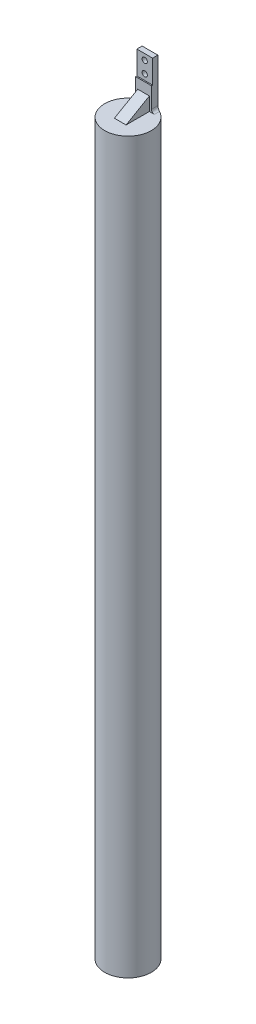
ISO-10303-21;
HEADER;
FILE_DESCRIPTION(('STEP AP214'),'2;1');
FILE_NAME('part.step','',(''),(''),'','','');
FILE_SCHEMA(('AUTOMOTIVE_DESIGN { 1 0 10303 214 1 1 1 1 }'));
ENDSEC;
DATA;
#1=APPLICATION_CONTEXT('core data for automotive mechanical design processes');
#2=APPLICATION_PROTOCOL_DEFINITION('international standard','automotive_design',2000,#1);
#3=PRODUCT_CONTEXT('',#1,'mechanical');
#4=PRODUCT('Part','Part','',(#3));
#5=PRODUCT_RELATED_PRODUCT_CATEGORY('part','',(#4));
#6=PRODUCT_DEFINITION_FORMATION('','',#4);
#7=PRODUCT_DEFINITION_CONTEXT('part definition',#1,'design');
#8=PRODUCT_DEFINITION('design','',#6,#7);
#9=PRODUCT_DEFINITION_SHAPE('','',#8);
#10=(LENGTH_UNIT() NAMED_UNIT(*) SI_UNIT(.MILLI.,.METRE.));
#11=(NAMED_UNIT(*) PLANE_ANGLE_UNIT() SI_UNIT($,.RADIAN.));
#12=(NAMED_UNIT(*) SI_UNIT($,.STERADIAN.) SOLID_ANGLE_UNIT());
#13=UNCERTAINTY_MEASURE_WITH_UNIT(LENGTH_MEASURE(1.E-05),#10,'distance_accuracy_value','');
#14=(GEOMETRIC_REPRESENTATION_CONTEXT(3) GLOBAL_UNCERTAINTY_ASSIGNED_CONTEXT((#13)) GLOBAL_UNIT_ASSIGNED_CONTEXT((#10,
#11,#12)) REPRESENTATION_CONTEXT('',''));
#15=CARTESIAN_POINT('',(0.,0.,0.));
#16=DIRECTION('',(0.,0.,1.));
#17=DIRECTION('',(1.,0.,0.));
#18=AXIS2_PLACEMENT_3D('',#15,#16,#17);
#19=CARTESIAN_POINT('',(-1.35,4.,0.55));
#20=DIRECTION('',(0.,0.,-1.));
#21=DIRECTION('',(-1.,0.,0.));
#22=AXIS2_PLACEMENT_3D('',#19,#20,#21);
#23=PLANE('',#22);
#24=DIRECTION('',(0.,1.,0.));
#25=VECTOR('',#24,1.);
#26=CARTESIAN_POINT('',(1.,0.,0.55));
#27=LINE('',#26,#25);
#28=CARTESIAN_POINT('',(1.,0.,0.55));
#29=VERTEX_POINT('',#28);
#30=CARTESIAN_POINT('',(1.,2.30940107675847,0.55));
#31=VERTEX_POINT('',#30);
#32=EDGE_CURVE('E297',#29,#31,#27,.T.);
#33=ORIENTED_EDGE('',*,*,#32,.F.);
#34=DIRECTION('',(1.,0.,0.));
#35=VECTOR('',#34,1.);
#36=CARTESIAN_POINT('',(-1.35,0.,0.55));
#37=LINE('',#36,#35);
#38=CARTESIAN_POINT('',(1.85,0.,0.55));
#39=VERTEX_POINT('',#38);
#40=EDGE_CURVE('E127',#29,#39,#37,.T.);
#41=ORIENTED_EDGE('',*,*,#40,.T.);
#42=CARTESIAN_POINT('',(1.85,0.5,0.55));
#43=DIRECTION('',(0.,0.,-1.));
#44=DIRECTION('',(-1.,0.,0.));
#45=AXIS2_PLACEMENT_3D('',#42,#43,#44);
#46=CIRCLE('',#45,0.5);
#47=CARTESIAN_POINT('',(1.35,0.5,0.55));
#48=VERTEX_POINT('',#47);
#49=EDGE_CURVE('E135',#39,#48,#46,.T.);
#50=ORIENTED_EDGE('',*,*,#49,.T.);
#51=DIRECTION('',(0.,-1.,0.));
#52=VECTOR('',#51,1.);
#53=CARTESIAN_POINT('',(1.35,4.,0.55));
#54=LINE('',#53,#52);
#55=CARTESIAN_POINT('',(1.35,4.,0.55));
#56=VERTEX_POINT('',#55);
#57=EDGE_CURVE('E246',#56,#48,#54,.T.);
#58=ORIENTED_EDGE('',*,*,#57,.F.);
#59=DIRECTION('',(1.,0.,0.));
#60=VECTOR('',#59,1.);
#61=CARTESIAN_POINT('',(-1.35,4.,0.55));
#62=LINE('',#61,#60);
#63=CARTESIAN_POINT('',(-1.35,4.,0.55));
#64=VERTEX_POINT('',#63);
#65=EDGE_CURVE('E243',#64,#56,#62,.T.);
#66=ORIENTED_EDGE('',*,*,#65,.F.);
#67=DIRECTION('',(0.,-1.,0.));
#68=VECTOR('',#67,1.);
#69=CARTESIAN_POINT('',(-1.35,4.,0.55));
#70=LINE('',#69,#68);
#71=CARTESIAN_POINT('',(-1.35,0.5,0.55));
#72=VERTEX_POINT('',#71);
#73=EDGE_CURVE('E133',#64,#72,#70,.T.);
#74=ORIENTED_EDGE('',*,*,#73,.T.);
#75=CARTESIAN_POINT('',(-1.85,0.5,0.55));
#76=DIRECTION('',(0.,0.,-1.));
#77=DIRECTION('',(-1.,0.,0.));
#78=AXIS2_PLACEMENT_3D('',#75,#76,#77);
#79=CIRCLE('',#78,0.5);
#80=CARTESIAN_POINT('',(-1.85,0.,0.55));
#81=VERTEX_POINT('',#80);
#82=EDGE_CURVE('E63',#72,#81,#79,.T.);
#83=ORIENTED_EDGE('',*,*,#82,.T.);
#84=CARTESIAN_POINT('',(-1.,0.,0.55));
#85=VERTEX_POINT('',#84);
#86=EDGE_CURVE('E117',#81,#85,#37,.T.);
#87=ORIENTED_EDGE('',*,*,#86,.T.);
#88=DIRECTION('',(0.,1.,0.));
#89=VECTOR('',#88,1.);
#90=CARTESIAN_POINT('',(-1.,0.,0.55));
#91=LINE('',#90,#89);
#92=CARTESIAN_POINT('',(-1.,2.30940107675847,0.55));
#93=VERTEX_POINT('',#92);
#94=EDGE_CURVE('E104',#85,#93,#91,.T.);
#95=ORIENTED_EDGE('',*,*,#94,.T.);
#96=DIRECTION('',(-1.,0.,0.));
#97=VECTOR('',#96,1.);
#98=CARTESIAN_POINT('',(1.,2.30940107675847,0.55));
#99=LINE('',#98,#97);
#100=EDGE_CURVE('E282',#31,#93,#99,.T.);
#101=ORIENTED_EDGE('',*,*,#100,.F.);
#102=EDGE_LOOP('',(#33,#41,#50,#58,#66,#74,#83,#87,#95,#101));
#103=FACE_BOUND('',#102,.T.);
#104=ADVANCED_FACE('F48',(#103),#23,.F.);
#105=CARTESIAN_POINT('',(0.,0.,0.));
#106=DIRECTION('',(0.,-1.,0.));
#107=DIRECTION('',(0.,0.,-1.));
#108=AXIS2_PLACEMENT_3D('',#105,#106,#107);
#109=PLANE('',#108);
#110=CARTESIAN_POINT('',(0.,0.,3.21530211271287));
#111=DIRECTION('',(0.,-1.,0.));
#112=DIRECTION('',(0.,0.,-1.));
#113=AXIS2_PLACEMENT_3D('',#110,#111,#112);
#114=CIRCLE('',#113,4.);
#115=CARTESIAN_POINT('',(1.85,0.,-0.331175012548196));
#116=VERTEX_POINT('',#115);
#117=CARTESIAN_POINT('',(-1.85,0.,-0.331175012548196));
#118=VERTEX_POINT('',#117);
#119=EDGE_CURVE('E279',#116,#118,#114,.T.);
#120=ORIENTED_EDGE('',*,*,#119,.F.);
#121=DIRECTION('',(0.,0.,-1.));
#122=VECTOR('',#121,1.);
#123=CARTESIAN_POINT('',(1.85,0.,0.55));
#124=LINE('',#123,#122);
#125=EDGE_CURVE('E138',#116,#39,#124,.F.);
#126=ORIENTED_EDGE('',*,*,#125,.T.);
#127=ORIENTED_EDGE('',*,*,#40,.F.);
#128=DIRECTION('',(0.,0.,-1.));
#129=VECTOR('',#128,1.);
#130=CARTESIAN_POINT('',(1.,0.,4.55));
#131=LINE('',#130,#129);
#132=CARTESIAN_POINT('',(1.,0.,4.55));
#133=VERTEX_POINT('',#132);
#134=EDGE_CURVE('E294',#133,#29,#131,.T.);
#135=ORIENTED_EDGE('',*,*,#134,.F.);
#136=DIRECTION('',(-1.,0.,0.));
#137=VECTOR('',#136,1.);
#138=CARTESIAN_POINT('',(1.,0.,4.55));
#139=LINE('',#138,#137);
#140=CARTESIAN_POINT('',(-1.,0.,4.55));
#141=VERTEX_POINT('',#140);
#142=EDGE_CURVE('E291',#133,#141,#139,.T.);
#143=ORIENTED_EDGE('',*,*,#142,.T.);
#144=DIRECTION('',(0.,0.,-1.));
#145=VECTOR('',#144,1.);
#146=CARTESIAN_POINT('',(-1.,0.,4.55));
#147=LINE('',#146,#145);
#148=EDGE_CURVE('E123',#141,#85,#147,.T.);
#149=ORIENTED_EDGE('',*,*,#148,.T.);
#150=ORIENTED_EDGE('',*,*,#86,.F.);
#151=DIRECTION('',(0.,0.,1.));
#152=VECTOR('',#151,1.);
#153=CARTESIAN_POINT('',(-1.85,0.,-0.55));
#154=LINE('',#153,#152);
#155=EDGE_CURVE('E120',#81,#118,#154,.F.);
#156=ORIENTED_EDGE('',*,*,#155,.T.);
#157=EDGE_LOOP('',(#120,#126,#127,#135,#143,#149,#150,#156));
#158=FACE_BOUND('',#157,.T.);
#159=ADVANCED_FACE('F119',(#158),#109,.F.);
#160=CARTESIAN_POINT('',(1.35,4.,-0.55));
#161=DIRECTION('',(-1.,0.,0.));
#162=DIRECTION('',(0.,0.,1.));
#163=AXIS2_PLACEMENT_3D('',#160,#161,#162);
#164=PLANE('',#163);
#165=ORIENTED_EDGE('',*,*,#57,.T.);
#166=DIRECTION('',(0.,0.,-1.));
#167=VECTOR('',#166,1.);
#168=CARTESIAN_POINT('',(1.35,0.5,-0.55));
#169=LINE('',#168,#167);
#170=CARTESIAN_POINT('',(1.35,0.5,-0.55));
#171=VERTEX_POINT('',#170);
#172=EDGE_CURVE('E139',#48,#171,#169,.T.);
#173=ORIENTED_EDGE('',*,*,#172,.T.);
#174=DIRECTION('',(0.,-1.,0.));
#175=VECTOR('',#174,1.);
#176=CARTESIAN_POINT('',(1.35,4.,-0.55));
#177=LINE('',#176,#175);
#178=CARTESIAN_POINT('',(1.35,8.,-0.55));
#179=VERTEX_POINT('',#178);
#180=EDGE_CURVE('E149',#179,#171,#177,.T.);
#181=ORIENTED_EDGE('',*,*,#180,.F.);
#182=DIRECTION('',(0.,0.,-1.));
#183=VECTOR('',#182,1.);
#184=CARTESIAN_POINT('',(1.35,8.,-0.55));
#185=LINE('',#184,#183);
#186=CARTESIAN_POINT('',(1.35,8.,0.35));
#187=VERTEX_POINT('',#186);
#188=EDGE_CURVE('E262',#187,#179,#185,.T.);
#189=ORIENTED_EDGE('',*,*,#188,.F.);
#190=DIRECTION('',(0.,-1.,0.));
#191=VECTOR('',#190,1.);
#192=CARTESIAN_POINT('',(1.35,8.,0.35));
#193=LINE('',#192,#191);
#194=CARTESIAN_POINT('',(1.35,4.,0.35));
#195=VERTEX_POINT('',#194);
#196=EDGE_CURVE('E228',#187,#195,#193,.T.);
#197=ORIENTED_EDGE('',*,*,#196,.T.);
#198=DIRECTION('',(0.,0.,-1.));
#199=VECTOR('',#198,1.);
#200=CARTESIAN_POINT('',(1.35,4.,-0.55));
#201=LINE('',#200,#199);
#202=EDGE_CURVE('E126',#56,#195,#201,.T.);
#203=ORIENTED_EDGE('',*,*,#202,.F.);
#204=EDGE_LOOP('',(#165,#173,#181,#189,#197,#203));
#205=FACE_BOUND('',#204,.T.);
#206=ADVANCED_FACE('F172',(#205),#164,.F.);
#207=CARTESIAN_POINT('',(-1.35,4.,-0.55));
#208=DIRECTION('',(0.,0.,1.));
#209=DIRECTION('',(1.,0.,0.));
#210=AXIS2_PLACEMENT_3D('',#207,#208,#209);
#211=PLANE('',#210);
#212=CARTESIAN_POINT('',(0.,5.,-0.55));
#213=DIRECTION('',(0.,0.,1.));
#214=DIRECTION('',(1.,0.,0.));
#215=AXIS2_PLACEMENT_3D('',#212,#213,#214);
#216=CIRCLE('',#215,0.45);
#217=CARTESIAN_POINT('',(0.45,5.,-0.55));
#218=VERTEX_POINT('',#217);
#219=EDGE_CURVE('E303',#218,#218,#216,.F.);
#220=ORIENTED_EDGE('',*,*,#219,.F.);
#221=EDGE_LOOP('',(#220));
#222=FACE_BOUND('',#221,.T.);
#223=CARTESIAN_POINT('',(0.,7.,-0.55));
#224=DIRECTION('',(0.,0.,1.));
#225=DIRECTION('',(1.,0.,0.));
#226=AXIS2_PLACEMENT_3D('',#223,#224,#225);
#227=CIRCLE('',#226,0.45);
#228=CARTESIAN_POINT('',(0.449999999999999,7.,-0.55));
#229=VERTEX_POINT('',#228);
#230=EDGE_CURVE('E314',#229,#229,#227,.F.);
#231=ORIENTED_EDGE('',*,*,#230,.F.);
#232=EDGE_LOOP('',(#231));
#233=FACE_BOUND('',#232,.T.);
#234=ORIENTED_EDGE('',*,*,#180,.T.);
#235=DIRECTION('',(0.,1.,0.));
#236=VECTOR('',#235,1.);
#237=CARTESIAN_POINT('',(1.35,-125.,-0.55));
#238=LINE('',#237,#236);
#239=CARTESIAN_POINT('',(1.35,-125.,-0.55));
#240=VERTEX_POINT('',#239);
#241=EDGE_CURVE('E92',#240,#171,#238,.T.);
#242=ORIENTED_EDGE('',*,*,#241,.F.);
#243=DIRECTION('',(1.,0.,0.));
#244=VECTOR('',#243,1.);
#245=CARTESIAN_POINT('',(0.,-125.,-0.55));
#246=LINE('',#245,#244);
#247=CARTESIAN_POINT('',(-1.35,-125.,-0.55));
#248=VERTEX_POINT('',#247);
#249=EDGE_CURVE('E276',#248,#240,#246,.T.);
#250=ORIENTED_EDGE('',*,*,#249,.F.);
#251=DIRECTION('',(0.,1.,0.));
#252=VECTOR('',#251,1.);
#253=CARTESIAN_POINT('',(-1.35,-125.,-0.55));
#254=LINE('',#253,#252);
#255=CARTESIAN_POINT('',(-1.35,0.5,-0.55));
#256=VERTEX_POINT('',#255);
#257=EDGE_CURVE('E70',#248,#256,#254,.T.);
#258=ORIENTED_EDGE('',*,*,#257,.T.);
#259=DIRECTION('',(0.,-1.,0.));
#260=VECTOR('',#259,1.);
#261=CARTESIAN_POINT('',(-1.35,4.,-0.55));
#262=LINE('',#261,#260);
#263=CARTESIAN_POINT('',(-1.35,8.,-0.55));
#264=VERTEX_POINT('',#263);
#265=EDGE_CURVE('E253',#264,#256,#262,.T.);
#266=ORIENTED_EDGE('',*,*,#265,.F.);
#267=DIRECTION('',(-1.,0.,0.));
#268=VECTOR('',#267,1.);
#269=CARTESIAN_POINT('',(-1.35,8.,-0.55));
#270=LINE('',#269,#268);
#271=EDGE_CURVE('E214',#179,#264,#270,.T.);
#272=ORIENTED_EDGE('',*,*,#271,.F.);
#273=EDGE_LOOP('',(#234,#242,#250,#258,#266,#272));
#274=FACE_BOUND('',#273,.T.);
#275=ADVANCED_FACE('F175',(#222,#233,#274),#211,.F.);
#276=CARTESIAN_POINT('',(-1.35,4.,-0.55));
#277=DIRECTION('',(1.,0.,0.));
#278=DIRECTION('',(0.,0.,-1.));
#279=AXIS2_PLACEMENT_3D('',#276,#277,#278);
#280=PLANE('',#279);
#281=ORIENTED_EDGE('',*,*,#265,.T.);
#282=DIRECTION('',(0.,0.,1.));
#283=VECTOR('',#282,1.);
#284=CARTESIAN_POINT('',(-1.35,0.5,0.55));
#285=LINE('',#284,#283);
#286=EDGE_CURVE('E145',#256,#72,#285,.T.);
#287=ORIENTED_EDGE('',*,*,#286,.T.);
#288=ORIENTED_EDGE('',*,*,#73,.F.);
#289=DIRECTION('',(0.,0.,1.));
#290=VECTOR('',#289,1.);
#291=CARTESIAN_POINT('',(-1.35,4.,-0.55));
#292=LINE('',#291,#290);
#293=CARTESIAN_POINT('',(-1.35,4.,0.35));
#294=VERTEX_POINT('',#293);
#295=EDGE_CURVE('E224',#294,#64,#292,.T.);
#296=ORIENTED_EDGE('',*,*,#295,.F.);
#297=DIRECTION('',(0.,-1.,0.));
#298=VECTOR('',#297,1.);
#299=CARTESIAN_POINT('',(-1.35,8.,0.35));
#300=LINE('',#299,#298);
#301=CARTESIAN_POINT('',(-1.35,8.,0.35));
#302=VERTEX_POINT('',#301);
#303=EDGE_CURVE('E222',#302,#294,#300,.T.);
#304=ORIENTED_EDGE('',*,*,#303,.F.);
#305=DIRECTION('',(0.,0.,1.));
#306=VECTOR('',#305,1.);
#307=CARTESIAN_POINT('',(-1.35,8.,-0.55));
#308=LINE('',#307,#306);
#309=EDGE_CURVE('E205',#264,#302,#308,.T.);
#310=ORIENTED_EDGE('',*,*,#309,.F.);
#311=EDGE_LOOP('',(#281,#287,#288,#296,#304,#310));
#312=FACE_BOUND('',#311,.T.);
#313=ADVANCED_FACE('F179',(#312),#280,.F.);
#314=CARTESIAN_POINT('',(0.,4.,0.));
#315=DIRECTION('',(0.,1.,0.));
#316=DIRECTION('',(0.,0.,1.));
#317=AXIS2_PLACEMENT_3D('',#314,#315,#316);
#318=PLANE('',#317);
#319=DIRECTION('',(1.,0.,0.));
#320=VECTOR('',#319,1.);
#321=CARTESIAN_POINT('',(-1.35,4.,0.35));
#322=LINE('',#321,#320);
#323=EDGE_CURVE('E218',#294,#195,#322,.T.);
#324=ORIENTED_EDGE('',*,*,#323,.F.);
#325=ORIENTED_EDGE('',*,*,#295,.T.);
#326=ORIENTED_EDGE('',*,*,#65,.T.);
#327=ORIENTED_EDGE('',*,*,#202,.T.);
#328=EDGE_LOOP('',(#324,#325,#326,#327));
#329=FACE_BOUND('',#328,.T.);
#330=ADVANCED_FACE('F183',(#329),#318,.T.);
#331=CARTESIAN_POINT('',(-1.35,8.,0.35));
#332=DIRECTION('',(0.,0.,-1.));
#333=DIRECTION('',(-1.,0.,0.));
#334=AXIS2_PLACEMENT_3D('',#331,#332,#333);
#335=PLANE('',#334);
#336=CARTESIAN_POINT('',(0.,5.,0.35));
#337=DIRECTION('',(0.,0.,1.));
#338=DIRECTION('',(1.,0.,0.));
#339=AXIS2_PLACEMENT_3D('',#336,#337,#338);
#340=CIRCLE('',#339,0.45);
#341=CARTESIAN_POINT('',(0.45,5.,0.35));
#342=VERTEX_POINT('',#341);
#343=EDGE_CURVE('E318',#342,#342,#340,.T.);
#344=ORIENTED_EDGE('',*,*,#343,.F.);
#345=EDGE_LOOP('',(#344));
#346=FACE_BOUND('',#345,.T.);
#347=CARTESIAN_POINT('',(0.,7.,0.35));
#348=DIRECTION('',(0.,0.,1.));
#349=DIRECTION('',(1.,0.,0.));
#350=AXIS2_PLACEMENT_3D('',#347,#348,#349);
#351=CIRCLE('',#350,0.45);
#352=CARTESIAN_POINT('',(0.449999999999999,7.,0.35));
#353=VERTEX_POINT('',#352);
#354=EDGE_CURVE('E319',#353,#353,#351,.T.);
#355=ORIENTED_EDGE('',*,*,#354,.F.);
#356=EDGE_LOOP('',(#355));
#357=FACE_BOUND('',#356,.T.);
#358=ORIENTED_EDGE('',*,*,#323,.T.);
#359=ORIENTED_EDGE('',*,*,#196,.F.);
#360=DIRECTION('',(1.,0.,0.));
#361=VECTOR('',#360,1.);
#362=CARTESIAN_POINT('',(-1.35,8.,0.35));
#363=LINE('',#362,#361);
#364=EDGE_CURVE('E210',#302,#187,#363,.T.);
#365=ORIENTED_EDGE('',*,*,#364,.F.);
#366=ORIENTED_EDGE('',*,*,#303,.T.);
#367=EDGE_LOOP('',(#358,#359,#365,#366));
#368=FACE_BOUND('',#367,.T.);
#369=ADVANCED_FACE('F189',(#346,#357,#368),#335,.F.);
#370=CARTESIAN_POINT('',(0.,8.,0.));
#371=DIRECTION('',(0.,1.,0.));
#372=DIRECTION('',(0.,0.,1.));
#373=AXIS2_PLACEMENT_3D('',#370,#371,#372);
#374=PLANE('',#373);
#375=ORIENTED_EDGE('',*,*,#309,.T.);
#376=ORIENTED_EDGE('',*,*,#364,.T.);
#377=ORIENTED_EDGE('',*,*,#188,.T.);
#378=ORIENTED_EDGE('',*,*,#271,.T.);
#379=EDGE_LOOP('',(#375,#376,#377,#378));
#380=FACE_BOUND('',#379,.T.);
#381=ADVANCED_FACE('F192',(#380),#374,.T.);
#382=CARTESIAN_POINT('',(0.,-125.,3.21530211271287));
#383=DIRECTION('',(0.,1.,0.));
#384=DIRECTION('',(0.,0.,1.));
#385=AXIS2_PLACEMENT_3D('',#382,#383,#384);
#386=CYLINDRICAL_SURFACE('',#385,4.);
#387=ORIENTED_EDGE('',*,*,#241,.T.);
#388=CARTESIAN_POINT('',(1.35,0.5,-0.55));
#389=CARTESIAN_POINT('',(1.34997090195875,0.473198524968782,-0.550002243818812));
#390=CARTESIAN_POINT('',(1.35215305094598,0.446410317430601,-0.549227958431106));
#391=CARTESIAN_POINT('',(1.36071871733916,0.393658793359086,-0.546144610104648));
#392=CARTESIAN_POINT('',(1.36709372564745,0.36769391756682,-0.543838655481468));
#393=CARTESIAN_POINT('',(1.38382650133436,0.31727023538279,-0.537709800160067));
#394=CARTESIAN_POINT('',(1.39418469714071,0.292811591328262,-0.533886736281645));
#395=CARTESIAN_POINT('',(1.41848751430449,0.24604917202692,-0.524759671770074));
#396=CARTESIAN_POINT('',(1.43243268062017,0.223745724922004,-0.519455446097717));
#397=CARTESIAN_POINT('',(1.46368962207486,0.181459460173602,-0.507317591963952));
#398=CARTESIAN_POINT('',(1.48105729965458,0.161525445920596,-0.500458236118475));
#399=CARTESIAN_POINT('',(1.51838576705184,0.124878041151484,-0.485361291824793));
#400=CARTESIAN_POINT('',(1.53834673420621,0.108164871080521,-0.477123609111412));
#401=CARTESIAN_POINT('',(1.58135691745601,0.0774285561912871,-0.458916617938842));
#402=CARTESIAN_POINT('',(1.60451452249281,0.0635985910272205,-0.44887797623742));
#403=CARTESIAN_POINT('',(1.65229976284232,0.0399715877819335,-0.427580184457249));
#404=CARTESIAN_POINT('',(1.67692877662281,0.0301784015438763,-0.416319881563706));
#405=CARTESIAN_POINT('',(1.72627010946394,0.0148820067679498,-0.393119964744483));
#406=CARTESIAN_POINT('',(1.75096132425594,0.00926774155177235,-0.381207716793099));
#407=CARTESIAN_POINT('',(1.80048843784235,0.00182739686989714,-0.356674962917835));
#408=CARTESIAN_POINT('',(1.82532383327438,-7.93953990114293E-06,-0.344056265684021));
#409=CARTESIAN_POINT('',(1.85,0.,-0.331175012548196));
#410=B_SPLINE_CURVE_WITH_KNOTS('',3,(#388,#389,#390,#391,#392,#393,#394,#395,#396,#397,#398,
#399,#400,#401,#402,#403,#404,#405,#406,#407,#408,#409),.UNSPECIFIED.,.F.,.F.,(4,2,2,2,2,2,2,2,
2,2,4),(0.,0.0802843791080306,0.160406327684157,0.240536896510213,0.320679646544526,
0.402259979712394,0.483845894524453,0.569822604310813,0.655881163129096,0.739561903804029,
0.823037413301743),.UNSPECIFIED.);
#411=EDGE_CURVE('E155',#171,#116,#410,.T.);
#412=ORIENTED_EDGE('',*,*,#411,.T.);
#413=ORIENTED_EDGE('',*,*,#119,.T.);
#414=CARTESIAN_POINT('',(-1.85,0.,-0.331175012548196));
#415=CARTESIAN_POINT('',(-1.82062708190596,-1.90039861263472E-05,-0.34651593436078));
#416=CARTESIAN_POINT('',(-1.79101099622219,0.00258970139961526,-0.361482341604251));
#417=CARTESIAN_POINT('',(-1.73209453254573,0.013180485231796,-0.390373121318766));
#418=CARTESIAN_POINT('',(-1.7027958405185,0.0211835216990706,-0.404293193221084));
#419=CARTESIAN_POINT('',(-1.64547313265493,0.0427153646766754,-0.430713013230717));
#420=CARTESIAN_POINT('',(-1.61745326372209,0.0562608997935151,-0.44320831374864));
#421=CARTESIAN_POINT('',(-1.56394531028327,0.0887229766913226,-0.466398842739301));
#422=CARTESIAN_POINT('',(-1.53845241474266,0.107629036931636,-0.477097519814889));
#423=CARTESIAN_POINT('',(-1.49307850826787,0.148626395349048,-0.495663992377373));
#424=CARTESIAN_POINT('',(-1.4729074127445,0.17032344687555,-0.503692985754126));
#425=CARTESIAN_POINT('',(-1.43649204155026,0.217344309302827,-0.517910167582713));
#426=CARTESIAN_POINT('',(-1.42024825139914,0.242668568007595,-0.524098128455572));
#427=CARTESIAN_POINT('',(-1.39357532674358,0.293977378951918,-0.534115852408125));
#428=CARTESIAN_POINT('',(-1.38278380740021,0.319745307516572,-0.538095167369172));
#429=CARTESIAN_POINT('',(-1.365625317178,0.372887137645386,-0.544372368971936));
#430=CARTESIAN_POINT('',(-1.35925129547885,0.400258404006439,-0.546672935396064));
#431=CARTESIAN_POINT('',(-1.35347777845555,0.439902209338468,-0.54875161651658));
#432=CARTESIAN_POINT('',(-1.35217369126867,0.451889839260831,-0.549220085471915));
#433=CARTESIAN_POINT('',(-1.35043569051116,0.47591628219866,-0.549843844820367));
#434=CARTESIAN_POINT('',(-1.35000034856837,0.487954978530394,-0.549999649292048));
#435=CARTESIAN_POINT('',(-1.3499999999999,0.499999999999953,-0.550000000000614));
#436=B_SPLINE_CURVE_WITH_KNOTS('',3,(#414,#415,#416,#417,#418,#419,#420,#421,#422,#423,#424,
#425,#426,#427,#428,#429,#430,#431,#432,#433,#434,#435),.UNSPECIFIED.,.F.,.F.,(4,2,2,2,2,2,2,2,
2,2,4),(0.,0.0993732974564927,0.19913492200248,0.299199898868728,0.39907055027739,
0.490657812892839,0.582256392355548,0.66649362063662,0.750596085297058,0.786769237629586,
0.822882865681804),.UNSPECIFIED.);
#437=EDGE_CURVE('E11',#118,#256,#436,.T.);
#438=ORIENTED_EDGE('',*,*,#437,.T.);
#439=ORIENTED_EDGE('',*,*,#257,.F.);
#440=CARTESIAN_POINT('',(0.,-125.,3.21530211271287));
#441=DIRECTION('',(0.,-1.,0.));
#442=DIRECTION('',(0.,0.,-1.));
#443=AXIS2_PLACEMENT_3D('',#440,#441,#442);
#444=CIRCLE('',#443,4.);
#445=EDGE_CURVE('E281',#240,#248,#444,.T.);
#446=ORIENTED_EDGE('',*,*,#445,.F.);
#447=EDGE_LOOP('',(#387,#412,#413,#438,#439,#446));
#448=FACE_BOUND('',#447,.T.);
#449=ADVANCED_FACE('F162',(#448),#386,.T.);
#450=CARTESIAN_POINT('',(0.,-125.,0.));
#451=DIRECTION('',(0.,-1.,0.));
#452=DIRECTION('',(0.,0.,-1.));
#453=AXIS2_PLACEMENT_3D('',#450,#451,#452);
#454=PLANE('',#453);
#455=ORIENTED_EDGE('',*,*,#445,.T.);
#456=ORIENTED_EDGE('',*,*,#249,.T.);
#457=EDGE_LOOP('',(#455,#456));
#458=FACE_BOUND('',#457,.T.);
#459=ADVANCED_FACE('F199',(#458),#454,.T.);
#460=CARTESIAN_POINT('',(1.,2.30940107675847,0.55));
#461=DIRECTION('',(0.,-0.866025403784442,-0.499999999999995));
#462=DIRECTION('',(0.,0.499999999999995,-0.866025403784442));
#463=AXIS2_PLACEMENT_3D('',#460,#461,#462);
#464=PLANE('',#463);
#465=DIRECTION('',(0.,-0.499999999999995,0.866025403784442));
#466=VECTOR('',#465,1.);
#467=CARTESIAN_POINT('',(-1.,2.30940107675847,0.55));
#468=LINE('',#467,#466);
#469=EDGE_CURVE('E298',#93,#141,#468,.T.);
#470=ORIENTED_EDGE('',*,*,#469,.T.);
#471=ORIENTED_EDGE('',*,*,#142,.F.);
#472=DIRECTION('',(0.,-0.499999999999995,0.866025403784442));
#473=VECTOR('',#472,1.);
#474=CARTESIAN_POINT('',(1.,2.30940107675847,0.55));
#475=LINE('',#474,#473);
#476=EDGE_CURVE('E307',#31,#133,#475,.T.);
#477=ORIENTED_EDGE('',*,*,#476,.F.);
#478=ORIENTED_EDGE('',*,*,#100,.T.);
#479=EDGE_LOOP('',(#470,#471,#477,#478));
#480=FACE_BOUND('',#479,.T.);
#481=ADVANCED_FACE('F346',(#480),#464,.F.);
#482=CARTESIAN_POINT('',(1.,0.,0.));
#483=DIRECTION('',(-1.,0.,0.));
#484=DIRECTION('',(0.,0.,1.));
#485=AXIS2_PLACEMENT_3D('',#482,#483,#484);
#486=PLANE('',#485);
#487=ORIENTED_EDGE('',*,*,#32,.T.);
#488=ORIENTED_EDGE('',*,*,#476,.T.);
#489=ORIENTED_EDGE('',*,*,#134,.T.);
#490=EDGE_LOOP('',(#487,#488,#489));
#491=FACE_BOUND('',#490,.T.);
#492=ADVANCED_FACE('F343',(#491),#486,.F.);
#493=CARTESIAN_POINT('',(-1.,0.,0.));
#494=DIRECTION('',(-1.,0.,0.));
#495=DIRECTION('',(0.,0.,1.));
#496=AXIS2_PLACEMENT_3D('',#493,#494,#495);
#497=PLANE('',#496);
#498=ORIENTED_EDGE('',*,*,#94,.F.);
#499=ORIENTED_EDGE('',*,*,#148,.F.);
#500=ORIENTED_EDGE('',*,*,#469,.F.);
#501=EDGE_LOOP('',(#498,#499,#500));
#502=FACE_BOUND('',#501,.T.);
#503=ADVANCED_FACE('F170',(#502),#497,.T.);
#504=CARTESIAN_POINT('',(1.85,0.5,-0.55));
#505=DIRECTION('',(0.,0.,1.));
#506=DIRECTION('',(1.,0.,0.));
#507=AXIS2_PLACEMENT_3D('',#504,#505,#506);
#508=CYLINDRICAL_SURFACE('',#507,0.5);
#509=ORIENTED_EDGE('',*,*,#49,.F.);
#510=ORIENTED_EDGE('',*,*,#125,.F.);
#511=ORIENTED_EDGE('',*,*,#411,.F.);
#512=ORIENTED_EDGE('',*,*,#172,.F.);
#513=EDGE_LOOP('',(#509,#510,#511,#512));
#514=FACE_BOUND('',#513,.T.);
#515=ADVANCED_FACE('F166',(#514),#508,.F.);
#516=CARTESIAN_POINT('',(-1.85,0.5,-0.55));
#517=DIRECTION('',(0.,0.,-1.));
#518=DIRECTION('',(-1.,0.,0.));
#519=AXIS2_PLACEMENT_3D('',#516,#517,#518);
#520=CYLINDRICAL_SURFACE('',#519,0.5);
#521=ORIENTED_EDGE('',*,*,#437,.F.);
#522=ORIENTED_EDGE('',*,*,#155,.F.);
#523=ORIENTED_EDGE('',*,*,#82,.F.);
#524=ORIENTED_EDGE('',*,*,#286,.F.);
#525=EDGE_LOOP('',(#521,#522,#523,#524));
#526=FACE_BOUND('',#525,.T.);
#527=ADVANCED_FACE('F50',(#526),#520,.F.);
#528=CARTESIAN_POINT('',(0.,7.,-1.82279220613579));
#529=DIRECTION('',(0.,0.,1.));
#530=DIRECTION('',(1.,0.,0.));
#531=AXIS2_PLACEMENT_3D('',#528,#529,#530);
#532=CYLINDRICAL_SURFACE('',#531,0.45);
#533=ORIENTED_EDGE('',*,*,#230,.T.);
#534=EDGE_LOOP('',(#533));
#535=FACE_BOUND('',#534,.T.);
#536=ORIENTED_EDGE('',*,*,#354,.T.);
#537=EDGE_LOOP('',(#536));
#538=FACE_BOUND('',#537,.T.);
#539=ADVANCED_FACE('F332',(#535,#538),#532,.F.);
#540=CARTESIAN_POINT('',(0.,5.,-1.82279220613579));
#541=DIRECTION('',(0.,0.,1.));
#542=DIRECTION('',(1.,0.,0.));
#543=AXIS2_PLACEMENT_3D('',#540,#541,#542);
#544=CYLINDRICAL_SURFACE('',#543,0.45);
#545=ORIENTED_EDGE('',*,*,#219,.T.);
#546=EDGE_LOOP('',(#545));
#547=FACE_BOUND('',#546,.T.);
#548=ORIENTED_EDGE('',*,*,#343,.T.);
#549=EDGE_LOOP('',(#548));
#550=FACE_BOUND('',#549,.T.);
#551=ADVANCED_FACE('F328',(#547,#550),#544,.F.);
#552=CLOSED_SHELL('',(#104,#159,#206,#275,#313,#330,#369,#381,#449,#459,#481,#492,#503,#515,
#527,#539,#551));
#553=MANIFOLD_SOLID_BREP('B2',#552);
#554=ADVANCED_BREP_SHAPE_REPRESENTATION('',(#18,#553),#14);
#555=SHAPE_DEFINITION_REPRESENTATION(#9,#554);
ENDSEC;
END-ISO-10303-21;
